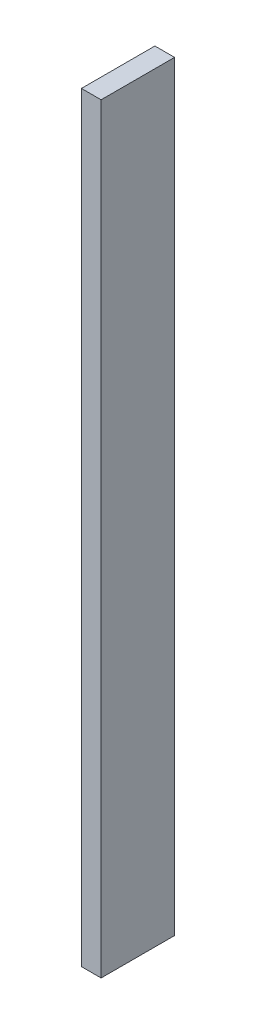
ISO-10303-21;
HEADER;
FILE_DESCRIPTION(('STEP AP214'),'2;1');
FILE_NAME('part.step','',(''),(''),'','','');
FILE_SCHEMA(('AUTOMOTIVE_DESIGN { 1 0 10303 214 1 1 1 1 }'));
ENDSEC;
DATA;
#1=APPLICATION_CONTEXT('core data for automotive mechanical design processes');
#2=APPLICATION_PROTOCOL_DEFINITION('international standard','automotive_design',2000,#1);
#3=PRODUCT_CONTEXT('',#1,'mechanical');
#4=PRODUCT('Part','Part','',(#3));
#5=PRODUCT_RELATED_PRODUCT_CATEGORY('part','',(#4));
#6=PRODUCT_DEFINITION_FORMATION('','',#4);
#7=PRODUCT_DEFINITION_CONTEXT('part definition',#1,'design');
#8=PRODUCT_DEFINITION('design','',#6,#7);
#9=PRODUCT_DEFINITION_SHAPE('','',#8);
#10=(LENGTH_UNIT() NAMED_UNIT(*) SI_UNIT(.MILLI.,.METRE.));
#11=(NAMED_UNIT(*) PLANE_ANGLE_UNIT() SI_UNIT($,.RADIAN.));
#12=(NAMED_UNIT(*) SI_UNIT($,.STERADIAN.) SOLID_ANGLE_UNIT());
#13=UNCERTAINTY_MEASURE_WITH_UNIT(LENGTH_MEASURE(1.E-05),#10,'distance_accuracy_value','');
#14=(GEOMETRIC_REPRESENTATION_CONTEXT(3) GLOBAL_UNCERTAINTY_ASSIGNED_CONTEXT((#13)) GLOBAL_UNIT_ASSIGNED_CONTEXT((#10,
#11,#12)) REPRESENTATION_CONTEXT('',''));
#15=CARTESIAN_POINT('',(0.,0.,0.));
#16=DIRECTION('',(0.,0.,1.));
#17=DIRECTION('',(1.,0.,0.));
#18=AXIS2_PLACEMENT_3D('',#15,#16,#17);
#19=CARTESIAN_POINT('',(-2.99999999999999,0.,0.));
#20=DIRECTION('',(0.,0.,1.));
#21=DIRECTION('',(1.,0.,0.));
#22=AXIS2_PLACEMENT_3D('',#19,#20,#21);
#23=PLANE('',#22);
#24=DIRECTION('',(0.,-1.,0.));
#25=VECTOR('',#24,1.);
#26=CARTESIAN_POINT('',(0.,0.,0.));
#27=LINE('',#26,#25);
#28=CARTESIAN_POINT('',(0.,115.957009142378,0.));
#29=VERTEX_POINT('',#28);
#30=CARTESIAN_POINT('',(0.,0.,0.));
#31=VERTEX_POINT('',#30);
#32=EDGE_CURVE('E97',#29,#31,#27,.T.);
#33=ORIENTED_EDGE('',*,*,#32,.F.);
#34=DIRECTION('',(1.,0.,0.));
#35=VECTOR('',#34,1.);
#36=CARTESIAN_POINT('',(-2.99999999999999,115.957009142378,0.));
#37=LINE('',#36,#35);
#38=CARTESIAN_POINT('',(-2.99999999999999,115.957009142378,0.));
#39=VERTEX_POINT('',#38);
#40=EDGE_CURVE('E11',#39,#29,#37,.T.);
#41=ORIENTED_EDGE('',*,*,#40,.F.);
#42=DIRECTION('',(0.,-1.,0.));
#43=VECTOR('',#42,1.);
#44=CARTESIAN_POINT('',(-2.99999999999999,0.,0.));
#45=LINE('',#44,#43);
#46=CARTESIAN_POINT('',(-2.99999999999999,0.,0.));
#47=VERTEX_POINT('',#46);
#48=EDGE_CURVE('E91',#39,#47,#45,.T.);
#49=ORIENTED_EDGE('',*,*,#48,.T.);
#50=DIRECTION('',(1.,0.,0.));
#51=VECTOR('',#50,1.);
#52=CARTESIAN_POINT('',(-2.99999999999999,0.,0.));
#53=LINE('',#52,#51);
#54=EDGE_CURVE('E36',#47,#31,#53,.T.);
#55=ORIENTED_EDGE('',*,*,#54,.T.);
#56=EDGE_LOOP('',(#33,#41,#49,#55));
#57=FACE_BOUND('',#56,.T.);
#58=ADVANCED_FACE('F33',(#57),#23,.T.);
#59=CARTESIAN_POINT('',(-2.99999999999999,115.957009142378,0.));
#60=DIRECTION('',(0.,1.,0.));
#61=DIRECTION('',(0.,0.,1.));
#62=AXIS2_PLACEMENT_3D('',#59,#60,#61);
#63=PLANE('',#62);
#64=DIRECTION('',(0.,0.,1.));
#65=VECTOR('',#64,1.);
#66=CARTESIAN_POINT('',(0.,115.957009142378,0.));
#67=LINE('',#66,#65);
#68=CARTESIAN_POINT('',(0.,115.957009142378,-11.2));
#69=VERTEX_POINT('',#68);
#70=EDGE_CURVE('E93',#69,#29,#67,.T.);
#71=ORIENTED_EDGE('',*,*,#70,.F.);
#72=DIRECTION('',(1.,0.,0.));
#73=VECTOR('',#72,1.);
#74=CARTESIAN_POINT('',(-2.99999999999999,115.957009142378,-11.2));
#75=LINE('',#74,#73);
#76=CARTESIAN_POINT('',(-2.99999999999999,115.957009142378,-11.2));
#77=VERTEX_POINT('',#76);
#78=EDGE_CURVE('E42',#77,#69,#75,.T.);
#79=ORIENTED_EDGE('',*,*,#78,.F.);
#80=DIRECTION('',(0.,0.,1.));
#81=VECTOR('',#80,1.);
#82=CARTESIAN_POINT('',(-2.99999999999999,115.957009142378,0.));
#83=LINE('',#82,#81);
#84=EDGE_CURVE('E88',#77,#39,#83,.T.);
#85=ORIENTED_EDGE('',*,*,#84,.T.);
#86=ORIENTED_EDGE('',*,*,#40,.T.);
#87=EDGE_LOOP('',(#71,#79,#85,#86));
#88=FACE_BOUND('',#87,.T.);
#89=ADVANCED_FACE('F107',(#88),#63,.T.);
#90=CARTESIAN_POINT('',(-2.99999999999999,0.,-11.2));
#91=DIRECTION('',(0.,0.,-1.));
#92=DIRECTION('',(-1.,0.,0.));
#93=AXIS2_PLACEMENT_3D('',#90,#91,#92);
#94=PLANE('',#93);
#95=DIRECTION('',(0.,1.,0.));
#96=VECTOR('',#95,1.);
#97=CARTESIAN_POINT('',(0.,0.,-11.2));
#98=LINE('',#97,#96);
#99=CARTESIAN_POINT('',(0.,0.,-11.2));
#100=VERTEX_POINT('',#99);
#101=EDGE_CURVE('E83',#100,#69,#98,.T.);
#102=ORIENTED_EDGE('',*,*,#101,.F.);
#103=DIRECTION('',(1.,0.,0.));
#104=VECTOR('',#103,1.);
#105=CARTESIAN_POINT('',(-2.99999999999999,0.,-11.2));
#106=LINE('',#105,#104);
#107=CARTESIAN_POINT('',(-2.99999999999999,0.,-11.2));
#108=VERTEX_POINT('',#107);
#109=EDGE_CURVE('E78',#108,#100,#106,.T.);
#110=ORIENTED_EDGE('',*,*,#109,.F.);
#111=DIRECTION('',(0.,1.,0.));
#112=VECTOR('',#111,1.);
#113=CARTESIAN_POINT('',(-2.99999999999999,0.,-11.2));
#114=LINE('',#113,#112);
#115=EDGE_CURVE('E81',#108,#77,#114,.T.);
#116=ORIENTED_EDGE('',*,*,#115,.T.);
#117=ORIENTED_EDGE('',*,*,#78,.T.);
#118=EDGE_LOOP('',(#102,#110,#116,#117));
#119=FACE_BOUND('',#118,.T.);
#120=ADVANCED_FACE('F80',(#119),#94,.T.);
#121=CARTESIAN_POINT('',(-2.99999999999999,0.,0.));
#122=DIRECTION('',(0.,-1.,0.));
#123=DIRECTION('',(0.,0.,-1.));
#124=AXIS2_PLACEMENT_3D('',#121,#122,#123);
#125=PLANE('',#124);
#126=DIRECTION('',(0.,0.,-1.));
#127=VECTOR('',#126,1.);
#128=CARTESIAN_POINT('',(0.,0.,0.));
#129=LINE('',#128,#127);
#130=EDGE_CURVE('E100',#31,#100,#129,.T.);
#131=ORIENTED_EDGE('',*,*,#130,.F.);
#132=ORIENTED_EDGE('',*,*,#54,.F.);
#133=DIRECTION('',(0.,0.,-1.));
#134=VECTOR('',#133,1.);
#135=CARTESIAN_POINT('',(-2.99999999999999,0.,0.));
#136=LINE('',#135,#134);
#137=EDGE_CURVE('E87',#47,#108,#136,.T.);
#138=ORIENTED_EDGE('',*,*,#137,.T.);
#139=ORIENTED_EDGE('',*,*,#109,.T.);
#140=EDGE_LOOP('',(#131,#132,#138,#139));
#141=FACE_BOUND('',#140,.T.);
#142=ADVANCED_FACE('F90',(#141),#125,.T.);
#143=CARTESIAN_POINT('',(-2.99999999999999,0.,0.));
#144=DIRECTION('',(-1.,0.,0.));
#145=DIRECTION('',(0.,0.,1.));
#146=AXIS2_PLACEMENT_3D('',#143,#144,#145);
#147=PLANE('',#146);
#148=ORIENTED_EDGE('',*,*,#48,.F.);
#149=ORIENTED_EDGE('',*,*,#84,.F.);
#150=ORIENTED_EDGE('',*,*,#115,.F.);
#151=ORIENTED_EDGE('',*,*,#137,.F.);
#152=EDGE_LOOP('',(#148,#149,#150,#151));
#153=FACE_BOUND('',#152,.T.);
#154=ADVANCED_FACE('F86',(#153),#147,.T.);
#155=CARTESIAN_POINT('',(0.,0.,0.));
#156=DIRECTION('',(-1.,0.,0.));
#157=DIRECTION('',(0.,0.,1.));
#158=AXIS2_PLACEMENT_3D('',#155,#156,#157);
#159=PLANE('',#158);
#160=ORIENTED_EDGE('',*,*,#32,.T.);
#161=ORIENTED_EDGE('',*,*,#130,.T.);
#162=ORIENTED_EDGE('',*,*,#101,.T.);
#163=ORIENTED_EDGE('',*,*,#70,.T.);
#164=EDGE_LOOP('',(#160,#161,#162,#163));
#165=FACE_BOUND('',#164,.T.);
#166=ADVANCED_FACE('F106',(#165),#159,.F.);
#167=CLOSED_SHELL('',(#58,#89,#120,#142,#154,#166));
#168=MANIFOLD_SOLID_BREP('B2',#167);
#169=ADVANCED_BREP_SHAPE_REPRESENTATION('',(#18,#168),#14);
#170=SHAPE_DEFINITION_REPRESENTATION(#9,#169);
ENDSEC;
END-ISO-10303-21;
